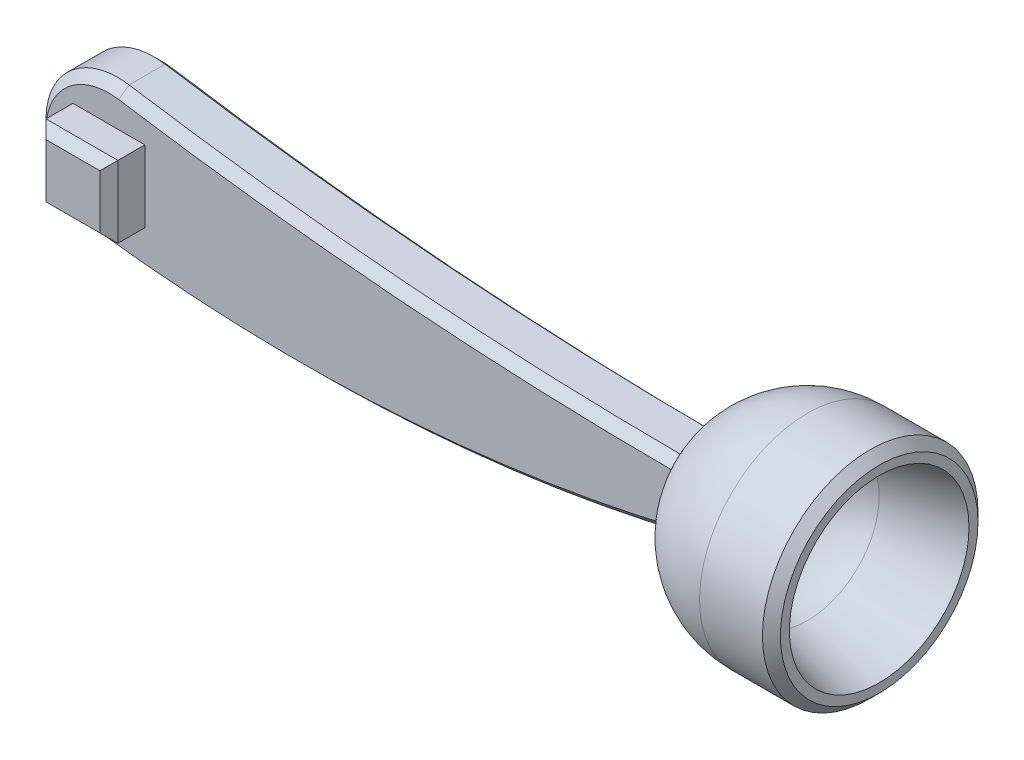
ISO-10303-21;
HEADER;
FILE_DESCRIPTION(('STEP AP214'),'2;1');
FILE_NAME('part.step','',(''),(''),'','','');
FILE_SCHEMA(('AUTOMOTIVE_DESIGN { 1 0 10303 214 1 1 1 1 }'));
ENDSEC;
DATA;
#1=APPLICATION_CONTEXT('core data for automotive mechanical design processes');
#2=APPLICATION_PROTOCOL_DEFINITION('international standard','automotive_design',2000,#1);
#3=PRODUCT_CONTEXT('',#1,'mechanical');
#4=PRODUCT('Part','Part','',(#3));
#5=PRODUCT_RELATED_PRODUCT_CATEGORY('part','',(#4));
#6=PRODUCT_DEFINITION_FORMATION('','',#4);
#7=PRODUCT_DEFINITION_CONTEXT('part definition',#1,'design');
#8=PRODUCT_DEFINITION('design','',#6,#7);
#9=PRODUCT_DEFINITION_SHAPE('','',#8);
#10=(LENGTH_UNIT() NAMED_UNIT(*) SI_UNIT(.MILLI.,.METRE.));
#11=(NAMED_UNIT(*) PLANE_ANGLE_UNIT() SI_UNIT($,.RADIAN.));
#12=(NAMED_UNIT(*) SI_UNIT($,.STERADIAN.) SOLID_ANGLE_UNIT());
#13=UNCERTAINTY_MEASURE_WITH_UNIT(LENGTH_MEASURE(1.E-05),#10,'distance_accuracy_value','');
#14=(GEOMETRIC_REPRESENTATION_CONTEXT(3) GLOBAL_UNCERTAINTY_ASSIGNED_CONTEXT((#13)) GLOBAL_UNIT_ASSIGNED_CONTEXT((#10,
#11,#12)) REPRESENTATION_CONTEXT('',''));
#15=CARTESIAN_POINT('',(0.,0.,0.));
#16=DIRECTION('',(0.,0.,1.));
#17=DIRECTION('',(1.,0.,0.));
#18=AXIS2_PLACEMENT_3D('',#15,#16,#17);
#19=CARTESIAN_POINT('',(0.,0.,7.5));
#20=DIRECTION('',(0.,0.,1.));
#21=DIRECTION('',(1.,0.,0.));
#22=AXIS2_PLACEMENT_3D('',#19,#20,#21);
#23=PLANE('',#22);
#24=CARTESIAN_POINT('',(101.914257424823,0.,7.5));
#25=DIRECTION('',(0.,0.,1.));
#26=DIRECTION('',(1.,0.,0.));
#27=AXIS2_PLACEMENT_3D('',#24,#25,#26);
#28=CIRCLE('',#27,29.0473750965556);
#29=CARTESIAN_POINT('',(73.2911495192701,4.94648297551503,7.5));
#30=VERTEX_POINT('',#29);
#31=CARTESIAN_POINT('',(73.9949003405566,-8.01620234283062,7.5));
#32=VERTEX_POINT('',#31);
#33=EDGE_CURVE('E166',#30,#32,#28,.T.);
#34=ORIENTED_EDGE('',*,*,#33,.F.);
#35=CARTESIAN_POINT('',(74.5404411764697,1007.44570455644,7.5));
#36=DIRECTION('',(0.,0.,1.));
#37=DIRECTION('',(1.,0.,0.));
#38=AXIS2_PLACEMENT_3D('',#35,#36,#37);
#39=CIRCLE('',#38,1002.5);
#40=CARTESIAN_POINT('',(-82.262786548443,17.284607676213,7.5));
#41=VERTEX_POINT('',#40);
#42=EDGE_CURVE('E318',#30,#41,#39,.F.);
#43=ORIENTED_EDGE('',*,*,#42,.T.);
#44=CARTESIAN_POINT('',(-85.,0.,7.5));
#45=DIRECTION('',(0.,0.,1.));
#46=DIRECTION('',(1.,0.,0.));
#47=AXIS2_PLACEMENT_3D('',#44,#45,#46);
#48=CIRCLE('',#47,17.4999999999998);
#49=CARTESIAN_POINT('',(-87.1538346443228,-17.366951267419,7.5));
#50=VERTEX_POINT('',#49);
#51=EDGE_CURVE('E335',#41,#50,#48,.T.);
#52=ORIENTED_EDGE('',*,*,#51,.T.);
#53=CARTESIAN_POINT('',(-32.0772058823531,426.730802570873,7.5));
#54=DIRECTION('',(0.,0.,1.));
#55=DIRECTION('',(1.,0.,0.));
#56=AXIS2_PLACEMENT_3D('',#53,#54,#55);
#57=CIRCLE('',#56,447.5);
#58=EDGE_CURVE('E332',#50,#32,#57,.T.);
#59=ORIENTED_EDGE('',*,*,#58,.T.);
#60=EDGE_LOOP('',(#34,#43,#52,#59));
#61=FACE_BOUND('',#60,.T.);
#62=DIRECTION('',(-1.,0.,0.));
#63=VECTOR('',#62,1.);
#64=CARTESIAN_POINT('',(-95.,10.,7.5));
#65=LINE('',#64,#63);
#66=CARTESIAN_POINT('',(-75.,10.,7.5));
#67=VERTEX_POINT('',#66);
#68=CARTESIAN_POINT('',(-95.,10.,7.5));
#69=VERTEX_POINT('',#68);
#70=EDGE_CURVE('E380',#67,#69,#65,.T.);
#71=ORIENTED_EDGE('',*,*,#70,.F.);
#72=DIRECTION('',(0.,1.,0.));
#73=VECTOR('',#72,1.);
#74=CARTESIAN_POINT('',(-75.,10.,7.5));
#75=LINE('',#74,#73);
#76=CARTESIAN_POINT('',(-75.,-10.,7.5));
#77=VERTEX_POINT('',#76);
#78=EDGE_CURVE('E374',#77,#67,#75,.T.);
#79=ORIENTED_EDGE('',*,*,#78,.F.);
#80=DIRECTION('',(1.,0.,0.));
#81=VECTOR('',#80,1.);
#82=CARTESIAN_POINT('',(-95.,-10.,7.5));
#83=LINE('',#82,#81);
#84=CARTESIAN_POINT('',(-95.,-10.,7.5));
#85=VERTEX_POINT('',#84);
#86=EDGE_CURVE('E391',#85,#77,#83,.T.);
#87=ORIENTED_EDGE('',*,*,#86,.F.);
#88=DIRECTION('',(0.,-1.,0.));
#89=VECTOR('',#88,1.);
#90=CARTESIAN_POINT('',(-95.,10.,7.5));
#91=LINE('',#90,#89);
#92=EDGE_CURVE('E386',#69,#85,#91,.T.);
#93=ORIENTED_EDGE('',*,*,#92,.F.);
#94=EDGE_LOOP('',(#71,#79,#87,#93));
#95=FACE_BOUND('',#94,.T.);
#96=ADVANCED_FACE('F45',(#61,#95),#23,.T.);
#97=CARTESIAN_POINT('',(-32.0772058823531,426.730802570873,7.5));
#98=DIRECTION('',(0.,0.,-1.));
#99=DIRECTION('',(-1.,0.,0.));
#100=AXIS2_PLACEMENT_3D('',#97,#98,#99);
#101=CYLINDRICAL_SURFACE('',#100,450.);
#102=CARTESIAN_POINT('',(-32.0772058823531,426.730802570873,-4.99999999999994));
#103=DIRECTION('',(0.,0.,1.));
#104=DIRECTION('',(1.,0.,0.));
#105=AXIS2_PLACEMENT_3D('',#102,#103,#104);
#106=CIRCLE('',#105,450.);
#107=CARTESIAN_POINT('',(-87.4615253077975,-19.847944305622,-4.99999999999994));
#108=VERTEX_POINT('',#107);
#109=CARTESIAN_POINT('',(74.2687364606456,-10.5226028443162,-4.99999999999994));
#110=VERTEX_POINT('',#109);
#111=EDGE_CURVE('E159',#108,#110,#106,.T.);
#112=ORIENTED_EDGE('',*,*,#111,.T.);
#113=CARTESIAN_POINT('',(74.2687695686907,-10.5225947919906,-5.00019999999994));
#114=CARTESIAN_POINT('',(74.2001978446423,-10.5392715353171,-4.58598398739804));
#115=CARTESIAN_POINT('',(74.1401511807636,-10.5538595525276,-4.17031957643629));
#116=CARTESIAN_POINT('',(74.0371975512156,-10.5788546815061,-3.33675034776046));
#117=CARTESIAN_POINT('',(73.9942905109663,-10.5892618114665,-2.9188455398031));
#118=CARTESIAN_POINT('',(73.8919121019454,-10.6140857190417,-1.66885072105893));
#119=CARTESIAN_POINT('',(73.8577834845445,-10.6223476725385,-0.834425360529481));
#120=CARTESIAN_POINT('',(73.8577834845445,-10.6223476725385,0.834425360529423));
#121=CARTESIAN_POINT('',(73.8919121019453,-10.6140857190417,1.66885072105888));
#122=CARTESIAN_POINT('',(73.9942905109663,-10.5892618114665,2.91884553980304));
#123=CARTESIAN_POINT('',(74.0371975512156,-10.5788546815061,3.3367503477604));
#124=CARTESIAN_POINT('',(74.1401511807636,-10.5538595525276,4.17031957643623));
#125=CARTESIAN_POINT('',(74.2001978446423,-10.5392715353171,4.58598398739798));
#126=CARTESIAN_POINT('',(74.2687695686907,-10.5225947919905,5.00019999999988));
#127=B_SPLINE_CURVE_WITH_KNOTS('',3,(#113,#114,#115,#116,#117,#118,#119,#120,#121,#122,#123,
#124,#125,#126),.UNSPECIFIED.,.F.,.F.,(4,2,2,2,2,2,4),(0.,1.26036718598642,2.52072888764981,
5.02308696773882,7.52544504782782,8.78580674949122,10.0461739354776),.UNSPECIFIED.);
#128=CARTESIAN_POINT('',(74.2687364606456,-10.5226028443163,4.99999999999983));
#129=VERTEX_POINT('',#128);
#130=EDGE_CURVE('E163',#110,#129,#127,.T.);
#131=ORIENTED_EDGE('',*,*,#130,.T.);
#132=CARTESIAN_POINT('',(-32.0772058823531,426.730802570873,4.99999999999989));
#133=DIRECTION('',(0.,0.,1.));
#134=DIRECTION('',(1.,0.,0.));
#135=AXIS2_PLACEMENT_3D('',#132,#133,#134);
#136=CIRCLE('',#135,450.);
#137=CARTESIAN_POINT('',(-87.4615253077975,-19.847944305622,4.99999999999989));
#138=VERTEX_POINT('',#137);
#139=EDGE_CURVE('E148',#129,#138,#136,.F.);
#140=ORIENTED_EDGE('',*,*,#139,.T.);
#141=DIRECTION('',(0.,0.,-1.));
#142=VECTOR('',#141,1.);
#143=CARTESIAN_POINT('',(-87.4615253077975,-19.847944305622,7.5));
#144=LINE('',#143,#142);
#145=EDGE_CURVE('E345',#138,#108,#144,.T.);
#146=ORIENTED_EDGE('',*,*,#145,.T.);
#147=EDGE_LOOP('',(#112,#131,#140,#146));
#148=FACE_BOUND('',#147,.T.);
#149=ADVANCED_FACE('F164',(#148),#101,.T.);
#150=CARTESIAN_POINT('',(74.5404411764697,1007.44570455644,7.5));
#151=DIRECTION('',(0.,0.,-1.));
#152=DIRECTION('',(-1.,0.,0.));
#153=AXIS2_PLACEMENT_3D('',#150,#151,#152);
#154=CYLINDRICAL_SURFACE('',#153,1000.);
#155=CARTESIAN_POINT('',(73.286512563604,7.44649072522967,-5.00019999999994));
#156=CARTESIAN_POINT('',(73.2142090344155,7.44658177137517,-4.58610748719957));
#157=CARTESIAN_POINT('',(73.150899769748,7.44666856853838,-4.17049403536112));
#158=CARTESIAN_POINT('',(73.0423598376574,7.44682513670235,-3.33691553209663));
#159=CARTESIAN_POINT('',(72.9971290674816,7.44689490779988,-2.91895049404999));
#160=CARTESIAN_POINT('',(72.8892408705057,7.44706502047559,-1.66895586641359));
#161=CARTESIAN_POINT('',(72.8532820902201,7.44712781031577,-0.834477933206809));
#162=CARTESIAN_POINT('',(72.8532820902201,7.4471278103158,0.834477933206751));
#163=CARTESIAN_POINT('',(72.8892408705057,7.44706502047566,1.66895586641353));
#164=CARTESIAN_POINT('',(72.9971290674815,7.44689490779986,2.91895049404994));
#165=CARTESIAN_POINT('',(73.0423598376574,7.44682513670227,3.33691553209658));
#166=CARTESIAN_POINT('',(73.150899769748,7.44666856853826,4.17049403536106));
#167=CARTESIAN_POINT('',(73.2142090344155,7.44658177137507,4.58610748719951));
#168=CARTESIAN_POINT('',(73.286512563604,7.44649072522968,5.00019999999989));
#169=B_SPLINE_CURVE_WITH_KNOTS('',3,(#155,#156,#157,#158,#159,#160,#161,#162,#163,#164,#165,
#166,#167,#168),.UNSPECIFIED.,.F.,.F.,(4,2,2,2,2,2,4),(0.,1.26087622855957,2.52174529057719,
5.02421637768941,7.52668746480162,8.78755652681925,10.0484327553788),.UNSPECIFIED.);
#170=CARTESIAN_POINT('',(73.2864776431684,7.44649076901804,-4.99999999999994));
#171=VERTEX_POINT('',#170);
#172=CARTESIAN_POINT('',(73.2864776431684,7.44649076901793,4.99999999999989));
#173=VERTEX_POINT('',#172);
#174=EDGE_CURVE('E228',#171,#173,#169,.T.);
#175=ORIENTED_EDGE('',*,*,#174,.F.);
#176=CARTESIAN_POINT('',(74.5404411764697,1007.44570455644,-4.99999999999994));
#177=DIRECTION('',(0.,0.,1.));
#178=DIRECTION('',(1.,0.,0.));
#179=AXIS2_PLACEMENT_3D('',#176,#177,#178);
#180=CIRCLE('',#179,1000.);
#181=CARTESIAN_POINT('',(-81.8717560553633,19.7538373442439,-4.99999999999994));
#182=VERTEX_POINT('',#181);
#183=EDGE_CURVE('E323',#171,#182,#180,.F.);
#184=ORIENTED_EDGE('',*,*,#183,.T.);
#185=DIRECTION('',(0.,0.,-1.));
#186=VECTOR('',#185,1.);
#187=CARTESIAN_POINT('',(-81.8717560553633,19.7538373442439,7.5));
#188=LINE('',#187,#186);
#189=CARTESIAN_POINT('',(-81.8717560553633,19.7538373442439,4.99999999999989));
#190=VERTEX_POINT('',#189);
#191=EDGE_CURVE('E322',#190,#182,#188,.T.);
#192=ORIENTED_EDGE('',*,*,#191,.F.);
#193=CARTESIAN_POINT('',(74.5404411764697,1007.44570455644,4.99999999999989));
#194=DIRECTION('',(0.,0.,1.));
#195=DIRECTION('',(1.,0.,0.));
#196=AXIS2_PLACEMENT_3D('',#193,#194,#195);
#197=CIRCLE('',#196,1000.);
#198=EDGE_CURVE('E309',#190,#173,#197,.T.);
#199=ORIENTED_EDGE('',*,*,#198,.T.);
#200=EDGE_LOOP('',(#175,#184,#192,#199));
#201=FACE_BOUND('',#200,.T.);
#202=ADVANCED_FACE('F242',(#201),#154,.F.);
#203=CARTESIAN_POINT('',(-85.,0.,7.5));
#204=DIRECTION('',(0.,0.,-1.));
#205=DIRECTION('',(-1.,0.,0.));
#206=AXIS2_PLACEMENT_3D('',#203,#204,#205);
#207=CYLINDRICAL_SURFACE('',#206,20.);
#208=ORIENTED_EDGE('',*,*,#191,.T.);
#209=CARTESIAN_POINT('',(-85.,0.,-4.99999999999994));
#210=DIRECTION('',(0.,0.,1.));
#211=DIRECTION('',(1.,0.,0.));
#212=AXIS2_PLACEMENT_3D('',#209,#210,#211);
#213=CIRCLE('',#212,20.);
#214=EDGE_CURVE('E160',#182,#108,#213,.T.);
#215=ORIENTED_EDGE('',*,*,#214,.T.);
#216=ORIENTED_EDGE('',*,*,#145,.F.);
#217=CARTESIAN_POINT('',(-85.,0.,4.99999999999989));
#218=DIRECTION('',(0.,0.,1.));
#219=DIRECTION('',(1.,0.,0.));
#220=AXIS2_PLACEMENT_3D('',#217,#218,#219);
#221=CIRCLE('',#220,20.);
#222=EDGE_CURVE('E325',#138,#190,#221,.F.);
#223=ORIENTED_EDGE('',*,*,#222,.T.);
#224=EDGE_LOOP('',(#208,#215,#216,#223));
#225=FACE_BOUND('',#224,.T.);
#226=ADVANCED_FACE('F246',(#225),#207,.T.);
#227=CARTESIAN_POINT('',(0.,0.,-7.5));
#228=DIRECTION('',(0.,0.,1.));
#229=DIRECTION('',(1.,0.,0.));
#230=AXIS2_PLACEMENT_3D('',#227,#228,#229);
#231=PLANE('',#230);
#232=CARTESIAN_POINT('',(-85.,0.,-7.5));
#233=DIRECTION('',(0.,0.,1.));
#234=DIRECTION('',(1.,0.,0.));
#235=AXIS2_PLACEMENT_3D('',#232,#233,#234);
#236=CIRCLE('',#235,5.);
#237=CARTESIAN_POINT('',(-80.,0.,-7.5));
#238=VERTEX_POINT('',#237);
#239=EDGE_CURVE('E174',#238,#238,#236,.F.);
#240=ORIENTED_EDGE('',*,*,#239,.F.);
#241=EDGE_LOOP('',(#240));
#242=FACE_BOUND('',#241,.T.);
#243=CARTESIAN_POINT('',(74.5404411764697,1007.44570455644,-7.5));
#244=DIRECTION('',(0.,0.,1.));
#245=DIRECTION('',(1.,0.,0.));
#246=AXIS2_PLACEMENT_3D('',#243,#244,#245);
#247=CIRCLE('',#246,1002.5);
#248=CARTESIAN_POINT('',(-82.2627865484429,17.2846076762134,-7.5));
#249=VERTEX_POINT('',#248);
#250=CARTESIAN_POINT('',(73.2911495192702,4.94648297551525,-7.5));
#251=VERTEX_POINT('',#250);
#252=EDGE_CURVE('E304',#249,#251,#247,.T.);
#253=ORIENTED_EDGE('',*,*,#252,.T.);
#254=CARTESIAN_POINT('',(101.914257424823,0.,-7.5));
#255=DIRECTION('',(0.,0.,1.));
#256=DIRECTION('',(1.,0.,0.));
#257=AXIS2_PLACEMENT_3D('',#254,#255,#256);
#258=CIRCLE('',#257,29.0473750965556);
#259=CARTESIAN_POINT('',(73.9949003405566,-8.01620234283079,-7.5));
#260=VERTEX_POINT('',#259);
#261=EDGE_CURVE('E61',#251,#260,#258,.T.);
#262=ORIENTED_EDGE('',*,*,#261,.T.);
#263=CARTESIAN_POINT('',(-32.0772058823531,426.730802570873,-7.5));
#264=DIRECTION('',(0.,0.,1.));
#265=DIRECTION('',(1.,0.,0.));
#266=AXIS2_PLACEMENT_3D('',#263,#264,#265);
#267=CIRCLE('',#266,447.5);
#268=CARTESIAN_POINT('',(-87.1538346443228,-17.3669512674192,-7.5));
#269=VERTEX_POINT('',#268);
#270=EDGE_CURVE('E403',#260,#269,#267,.F.);
#271=ORIENTED_EDGE('',*,*,#270,.T.);
#272=CARTESIAN_POINT('',(-85.,0.,-7.5));
#273=DIRECTION('',(0.,0.,1.));
#274=DIRECTION('',(1.,0.,0.));
#275=AXIS2_PLACEMENT_3D('',#272,#273,#274);
#276=CIRCLE('',#275,17.5);
#277=EDGE_CURVE('E306',#269,#249,#276,.F.);
#278=ORIENTED_EDGE('',*,*,#277,.T.);
#279=EDGE_LOOP('',(#253,#262,#271,#278));
#280=FACE_BOUND('',#279,.T.);
#281=ADVANCED_FACE('F272',(#242,#280),#231,.F.);
#282=CARTESIAN_POINT('',(-85.,0.,-4.99999999999994));
#283=DIRECTION('',(0.,0.,1.));
#284=DIRECTION('',(1.,0.,0.));
#285=AXIS2_PLACEMENT_3D('',#282,#283,#284);
#286=CONICAL_SURFACE('',#285,20.,0.785398163397444);
#287=DIRECTION('',(0.110600125322921,0.698403617028542,0.70710678118655));
#288=VECTOR('',#287,1.);
#289=CARTESIAN_POINT('',(-82.2627865484429,17.2846076762134,-7.5));
#290=LINE('',#289,#288);
#291=EDGE_CURVE('E339',#249,#182,#290,.T.);
#292=ORIENTED_EDGE('',*,*,#291,.F.);
#293=ORIENTED_EDGE('',*,*,#277,.F.);
#294=DIRECTION('',(0.0870280618602952,0.701730800555909,-0.707106781186551));
#295=VECTOR('',#294,1.);
#296=CARTESIAN_POINT('',(-87.4615253077975,-19.847944305622,-4.99999999999994));
#297=LINE('',#296,#295);
#298=EDGE_CURVE('E341',#108,#269,#297,.T.);
#299=ORIENTED_EDGE('',*,*,#298,.F.);
#300=ORIENTED_EDGE('',*,*,#214,.F.);
#301=EDGE_LOOP('',(#292,#293,#299,#300));
#302=FACE_BOUND('',#301,.T.);
#303=ADVANCED_FACE('F268',(#302),#286,.T.);
#304=CARTESIAN_POINT('',(-32.0772058823531,426.730802570873,-4.99999999999994));
#305=DIRECTION('',(0.,0.,1.));
#306=DIRECTION('',(1.,0.,0.));
#307=AXIS2_PLACEMENT_3D('',#304,#305,#306);
#308=CONICAL_SURFACE('',#307,450.,0.785398163397448);
#309=CARTESIAN_POINT('',(74.2687750608708,-10.5227992865202,-4.99979999999994));
#310=CARTESIAN_POINT('',(74.1879259381294,-10.1111815768424,-5.41887583292754));
#311=CARTESIAN_POINT('',(74.1246780643506,-9.69647258998657,-5.83678041610308));
#312=CARTESIAN_POINT('',(74.0333848147386,-8.86087206210038,-6.67024708276874));
#313=CARTESIAN_POINT('',(74.0053394388899,-8.43998052107275,-7.08580916625989));
#314=CARTESIAN_POINT('',(73.9948953119886,-8.01599770286971,-7.50019999999999));
#315=B_SPLINE_CURVE_WITH_KNOTS('',3,(#309,#310,#311,#312,#313,#314),.UNSPECIFIED.,.F.,.F.,(4,2,
4),(0.,1.77641568941536,3.55283137805793),.UNSPECIFIED.);
#316=EDGE_CURVE('E68',#110,#260,#315,.T.);
#317=ORIENTED_EDGE('',*,*,#316,.F.);
#318=ORIENTED_EDGE('',*,*,#111,.F.);
#319=ORIENTED_EDGE('',*,*,#298,.T.);
#320=ORIENTED_EDGE('',*,*,#270,.F.);
#321=EDGE_LOOP('',(#317,#318,#319,#320));
#322=FACE_BOUND('',#321,.T.);
#323=ADVANCED_FACE('F260',(#322),#308,.T.);
#324=CARTESIAN_POINT('',(74.5404411764697,1007.44570455644,-7.5));
#325=DIRECTION('',(0.,0.,-1.));
#326=DIRECTION('',(-1.,0.,0.));
#327=AXIS2_PLACEMENT_3D('',#324,#325,#326);
#328=CONICAL_SURFACE('',#327,1002.5,0.785398163397426);
#329=CARTESIAN_POINT('',(73.291167359151,4.94628295312843,-7.5002));
#330=CARTESIAN_POINT('',(73.2540319952611,5.36300683110372,-7.08352385363975));
#331=CARTESIAN_POINT('',(73.2350749276173,5.77973608630963,-6.66681911379298));
#332=CARTESIAN_POINT('',(73.2335173848215,6.61320535118287,-5.83335244712628));
#333=CARTESIAN_POINT('',(73.2509169096695,7.02994536085019,-5.41659052030635));
#334=CARTESIAN_POINT('',(73.2864947307635,7.44669074774815,-4.99979999999991));
#335=B_SPLINE_CURVE_WITH_KNOTS('',3,(#329,#330,#331,#332,#333,#334),.UNSPECIFIED.,.F.,.F.,(4,2,
4),(0.,1.76889495022177,3.53778990044409),.UNSPECIFIED.);
#336=EDGE_CURVE('E235',#251,#171,#335,.T.);
#337=ORIENTED_EDGE('',*,*,#336,.F.);
#338=ORIENTED_EDGE('',*,*,#252,.F.);
#339=ORIENTED_EDGE('',*,*,#291,.T.);
#340=ORIENTED_EDGE('',*,*,#183,.F.);
#341=EDGE_LOOP('',(#337,#338,#339,#340));
#342=FACE_BOUND('',#341,.T.);
#343=ADVANCED_FACE('F252',(#342),#328,.F.);
#344=CARTESIAN_POINT('',(74.5404411764697,1007.44570455644,4.99999999999989));
#345=DIRECTION('',(0.,0.,1.));
#346=DIRECTION('',(1.,0.,0.));
#347=AXIS2_PLACEMENT_3D('',#344,#345,#346);
#348=CONICAL_SURFACE('',#347,1000.,0.785398163397459);
#349=CARTESIAN_POINT('',(73.2864947307635,7.44669074774815,4.99979999999994));
#350=CARTESIAN_POINT('',(73.2509169096695,7.02994536085015,5.41659052030637));
#351=CARTESIAN_POINT('',(73.2335173848214,6.6132053511828,5.83335244712629));
#352=CARTESIAN_POINT('',(73.2350749276173,5.77973608630951,6.66681911379299));
#353=CARTESIAN_POINT('',(73.2540319952611,5.36300683110357,7.08352385363977));
#354=CARTESIAN_POINT('',(73.2911673591509,4.94628295312827,7.50020000000003));
#355=B_SPLINE_CURVE_WITH_KNOTS('',3,(#349,#350,#351,#352,#353,#354),.UNSPECIFIED.,.F.,.F.,(4,2,
4),(0.,1.76889495022238,3.53778990044421),.UNSPECIFIED.);
#356=EDGE_CURVE('E215',#173,#30,#355,.T.);
#357=ORIENTED_EDGE('',*,*,#356,.F.);
#358=ORIENTED_EDGE('',*,*,#198,.F.);
#359=DIRECTION('',(0.11060012532292,0.698403617028558,-0.707106781186535));
#360=VECTOR('',#359,1.);
#361=CARTESIAN_POINT('',(-82.262786548443,17.284607676213,7.5));
#362=LINE('',#361,#360);
#363=EDGE_CURVE('E342',#41,#190,#362,.T.);
#364=ORIENTED_EDGE('',*,*,#363,.F.);
#365=ORIENTED_EDGE('',*,*,#42,.F.);
#366=EDGE_LOOP('',(#357,#358,#364,#365));
#367=FACE_BOUND('',#366,.T.);
#368=ADVANCED_FACE('F259',(#367),#348,.F.);
#369=CARTESIAN_POINT('',(-32.0772058823531,426.730802570873,7.5));
#370=DIRECTION('',(0.,0.,-1.));
#371=DIRECTION('',(-1.,0.,0.));
#372=AXIS2_PLACEMENT_3D('',#369,#370,#371);
#373=CONICAL_SURFACE('',#372,447.5,0.78539816339747);
#374=CARTESIAN_POINT('',(73.9948953119886,-8.01599770286956,7.50019999999997));
#375=CARTESIAN_POINT('',(74.0053394388899,-8.43998052107262,7.08580916625987));
#376=CARTESIAN_POINT('',(74.0333848147385,-8.86087206210028,6.67024708276873));
#377=CARTESIAN_POINT('',(74.1246780643506,-9.69647258998652,5.83678041610306));
#378=CARTESIAN_POINT('',(74.1879259381293,-10.1111815768424,5.41887583292752));
#379=CARTESIAN_POINT('',(74.2687750608708,-10.5227992865202,4.99979999999991));
#380=B_SPLINE_CURVE_WITH_KNOTS('',3,(#374,#375,#376,#377,#378,#379),.UNSPECIFIED.,.F.,.F.,(4,2,
4),(0.,1.77641568864262,3.55283137805804),.UNSPECIFIED.);
#381=EDGE_CURVE('E153',#32,#129,#380,.T.);
#382=ORIENTED_EDGE('',*,*,#381,.F.);
#383=ORIENTED_EDGE('',*,*,#58,.F.);
#384=DIRECTION('',(0.0870280618602982,0.701730800555932,0.707106781186527));
#385=VECTOR('',#384,1.);
#386=CARTESIAN_POINT('',(-87.4615253077975,-19.847944305622,4.99999999999989));
#387=LINE('',#386,#385);
#388=EDGE_CURVE('E155',#138,#50,#387,.T.);
#389=ORIENTED_EDGE('',*,*,#388,.F.);
#390=ORIENTED_EDGE('',*,*,#139,.F.);
#391=EDGE_LOOP('',(#382,#383,#389,#390));
#392=FACE_BOUND('',#391,.T.);
#393=ADVANCED_FACE('F150',(#392),#373,.T.);
#394=CARTESIAN_POINT('',(-85.,0.,7.5));
#395=DIRECTION('',(0.,0.,-1.));
#396=DIRECTION('',(-1.,0.,0.));
#397=AXIS2_PLACEMENT_3D('',#394,#395,#396);
#398=CONICAL_SURFACE('',#397,17.4999999999998,0.785398163397466);
#399=ORIENTED_EDGE('',*,*,#363,.T.);
#400=ORIENTED_EDGE('',*,*,#222,.F.);
#401=ORIENTED_EDGE('',*,*,#388,.T.);
#402=ORIENTED_EDGE('',*,*,#51,.F.);
#403=EDGE_LOOP('',(#399,#400,#401,#402));
#404=FACE_BOUND('',#403,.T.);
#405=ADVANCED_FACE('F275',(#404),#398,.T.);
#406=CARTESIAN_POINT('',(-75.,10.,17.5));
#407=DIRECTION('',(-1.,0.,0.));
#408=DIRECTION('',(0.,0.,1.));
#409=AXIS2_PLACEMENT_3D('',#406,#407,#408);
#410=PLANE('',#409);
#411=DIRECTION('',(0.,0.,-1.));
#412=VECTOR('',#411,1.);
#413=CARTESIAN_POINT('',(-75.,10.,17.5));
#414=LINE('',#413,#412);
#415=CARTESIAN_POINT('',(-75.,10.,15.));
#416=VERTEX_POINT('',#415);
#417=EDGE_CURVE('E347',#416,#67,#414,.T.);
#418=ORIENTED_EDGE('',*,*,#417,.F.);
#419=DIRECTION('',(0.,-1.,0.));
#420=VECTOR('',#419,1.);
#421=CARTESIAN_POINT('',(-75.,-10.,15.));
#422=LINE('',#421,#420);
#423=CARTESIAN_POINT('',(-75.,-10.,15.));
#424=VERTEX_POINT('',#423);
#425=EDGE_CURVE('E179',#416,#424,#422,.T.);
#426=ORIENTED_EDGE('',*,*,#425,.T.);
#427=DIRECTION('',(0.,0.,-1.));
#428=VECTOR('',#427,1.);
#429=CARTESIAN_POINT('',(-75.,-10.,17.5));
#430=LINE('',#429,#428);
#431=EDGE_CURVE('E394',#424,#77,#430,.T.);
#432=ORIENTED_EDGE('',*,*,#431,.T.);
#433=ORIENTED_EDGE('',*,*,#78,.T.);
#434=EDGE_LOOP('',(#418,#426,#432,#433));
#435=FACE_BOUND('',#434,.T.);
#436=ADVANCED_FACE('F280',(#435),#410,.F.);
#437=CARTESIAN_POINT('',(-95.,10.,17.5));
#438=DIRECTION('',(0.,-1.,0.));
#439=DIRECTION('',(0.,0.,-1.));
#440=AXIS2_PLACEMENT_3D('',#437,#438,#439);
#441=PLANE('',#440);
#442=DIRECTION('',(0.,0.,-1.));
#443=VECTOR('',#442,1.);
#444=CARTESIAN_POINT('',(-95.,10.,17.5));
#445=LINE('',#444,#443);
#446=CARTESIAN_POINT('',(-95.,10.,15.));
#447=VERTEX_POINT('',#446);
#448=EDGE_CURVE('E398',#447,#69,#445,.T.);
#449=ORIENTED_EDGE('',*,*,#448,.F.);
#450=DIRECTION('',(1.,0.,0.));
#451=VECTOR('',#450,1.);
#452=CARTESIAN_POINT('',(-75.,10.,15.));
#453=LINE('',#452,#451);
#454=EDGE_CURVE('E357',#447,#416,#453,.T.);
#455=ORIENTED_EDGE('',*,*,#454,.T.);
#456=ORIENTED_EDGE('',*,*,#417,.T.);
#457=ORIENTED_EDGE('',*,*,#70,.T.);
#458=EDGE_LOOP('',(#449,#455,#456,#457));
#459=FACE_BOUND('',#458,.T.);
#460=ADVANCED_FACE('F286',(#459),#441,.F.);
#461=CARTESIAN_POINT('',(-95.,10.,17.5));
#462=DIRECTION('',(1.,0.,0.));
#463=DIRECTION('',(0.,0.,-1.));
#464=AXIS2_PLACEMENT_3D('',#461,#462,#463);
#465=PLANE('',#464);
#466=DIRECTION('',(0.,0.,-1.));
#467=VECTOR('',#466,1.);
#468=CARTESIAN_POINT('',(-95.,-10.,17.5));
#469=LINE('',#468,#467);
#470=CARTESIAN_POINT('',(-95.,-10.,15.));
#471=VERTEX_POINT('',#470);
#472=EDGE_CURVE('E396',#471,#85,#469,.T.);
#473=ORIENTED_EDGE('',*,*,#472,.F.);
#474=DIRECTION('',(0.,1.,0.));
#475=VECTOR('',#474,1.);
#476=CARTESIAN_POINT('',(-95.,10.,15.));
#477=LINE('',#476,#475);
#478=EDGE_CURVE('E360',#471,#447,#477,.T.);
#479=ORIENTED_EDGE('',*,*,#478,.T.);
#480=ORIENTED_EDGE('',*,*,#448,.T.);
#481=ORIENTED_EDGE('',*,*,#92,.T.);
#482=EDGE_LOOP('',(#473,#479,#480,#481));
#483=FACE_BOUND('',#482,.T.);
#484=ADVANCED_FACE('F432',(#483),#465,.F.);
#485=CARTESIAN_POINT('',(-95.,-10.,17.5));
#486=DIRECTION('',(0.,1.,0.));
#487=DIRECTION('',(0.,0.,1.));
#488=AXIS2_PLACEMENT_3D('',#485,#486,#487);
#489=PLANE('',#488);
#490=ORIENTED_EDGE('',*,*,#431,.F.);
#491=DIRECTION('',(-1.,0.,0.));
#492=VECTOR('',#491,1.);
#493=CARTESIAN_POINT('',(-95.,-10.,15.));
#494=LINE('',#493,#492);
#495=EDGE_CURVE('E362',#424,#471,#494,.T.);
#496=ORIENTED_EDGE('',*,*,#495,.T.);
#497=ORIENTED_EDGE('',*,*,#472,.T.);
#498=ORIENTED_EDGE('',*,*,#86,.T.);
#499=EDGE_LOOP('',(#490,#496,#497,#498));
#500=FACE_BOUND('',#499,.T.);
#501=ADVANCED_FACE('F428',(#500),#489,.F.);
#502=CARTESIAN_POINT('',(0.,0.,17.5));
#503=DIRECTION('',(0.,0.,1.));
#504=DIRECTION('',(1.,0.,0.));
#505=AXIS2_PLACEMENT_3D('',#502,#503,#504);
#506=PLANE('',#505);
#507=DIRECTION('',(0.,1.,0.));
#508=VECTOR('',#507,1.);
#509=CARTESIAN_POINT('',(-77.5,10.,17.5));
#510=LINE('',#509,#508);
#511=CARTESIAN_POINT('',(-77.5,-7.5,17.5));
#512=VERTEX_POINT('',#511);
#513=CARTESIAN_POINT('',(-77.5,7.5,17.5));
#514=VERTEX_POINT('',#513);
#515=EDGE_CURVE('E338',#512,#514,#510,.T.);
#516=ORIENTED_EDGE('',*,*,#515,.T.);
#517=DIRECTION('',(-1.,0.,0.));
#518=VECTOR('',#517,1.);
#519=CARTESIAN_POINT('',(-95.,7.5,17.5));
#520=LINE('',#519,#518);
#521=CARTESIAN_POINT('',(-92.5,7.5,17.5));
#522=VERTEX_POINT('',#521);
#523=EDGE_CURVE('E354',#514,#522,#520,.T.);
#524=ORIENTED_EDGE('',*,*,#523,.T.);
#525=DIRECTION('',(0.,-1.,0.));
#526=VECTOR('',#525,1.);
#527=CARTESIAN_POINT('',(-92.5,-10.,17.5));
#528=LINE('',#527,#526);
#529=CARTESIAN_POINT('',(-92.5,-7.5,17.5));
#530=VERTEX_POINT('',#529);
#531=EDGE_CURVE('E352',#522,#530,#528,.T.);
#532=ORIENTED_EDGE('',*,*,#531,.T.);
#533=DIRECTION('',(1.,0.,0.));
#534=VECTOR('',#533,1.);
#535=CARTESIAN_POINT('',(-75.,-7.5,17.5));
#536=LINE('',#535,#534);
#537=EDGE_CURVE('E350',#530,#512,#536,.T.);
#538=ORIENTED_EDGE('',*,*,#537,.T.);
#539=EDGE_LOOP('',(#516,#524,#532,#538));
#540=FACE_BOUND('',#539,.T.);
#541=ADVANCED_FACE('F424',(#540),#506,.T.);
#542=CARTESIAN_POINT('',(0.,-7.5,17.5));
#543=DIRECTION('',(0.,-0.707106781186551,0.707106781186543));
#544=DIRECTION('',(-1.,0.,0.));
#545=AXIS2_PLACEMENT_3D('',#542,#543,#544);
#546=PLANE('',#545);
#547=DIRECTION('',(-0.577350269189624,-0.577350269189624,-0.57735026918963));
#548=VECTOR('',#547,1.);
#549=CARTESIAN_POINT('',(-61.6666666666669,23.3333333333331,48.3333333333334));
#550=LINE('',#549,#548);
#551=EDGE_CURVE('E370',#471,#530,#550,.F.);
#552=ORIENTED_EDGE('',*,*,#551,.F.);
#553=ORIENTED_EDGE('',*,*,#495,.F.);
#554=DIRECTION('',(0.577350269189624,-0.577350269189624,-0.57735026918963));
#555=VECTOR('',#554,1.);
#556=CARTESIAN_POINT('',(-80.,-5.00000000000002,20.));
#557=LINE('',#556,#555);
#558=EDGE_CURVE('E372',#512,#424,#557,.T.);
#559=ORIENTED_EDGE('',*,*,#558,.F.);
#560=ORIENTED_EDGE('',*,*,#537,.F.);
#561=EDGE_LOOP('',(#552,#553,#559,#560));
#562=FACE_BOUND('',#561,.T.);
#563=ADVANCED_FACE('F427',(#562),#546,.T.);
#564=CARTESIAN_POINT('',(-77.5,0.,17.5));
#565=DIRECTION('',(0.707106781186551,0.,0.707106781186543));
#566=DIRECTION('',(0.,-1.,0.));
#567=AXIS2_PLACEMENT_3D('',#564,#565,#566);
#568=PLANE('',#567);
#569=ORIENTED_EDGE('',*,*,#558,.T.);
#570=ORIENTED_EDGE('',*,*,#425,.F.);
#571=DIRECTION('',(-0.577350269189624,-0.577350269189624,0.57735026918963));
#572=VECTOR('',#571,1.);
#573=CARTESIAN_POINT('',(-80.,5.00000000000002,20.));
#574=LINE('',#573,#572);
#575=EDGE_CURVE('E367',#514,#416,#574,.F.);
#576=ORIENTED_EDGE('',*,*,#575,.F.);
#577=ORIENTED_EDGE('',*,*,#515,.F.);
#578=EDGE_LOOP('',(#569,#570,#576,#577));
#579=FACE_BOUND('',#578,.T.);
#580=ADVANCED_FACE('F451',(#579),#568,.T.);
#581=CARTESIAN_POINT('',(-92.5,0.,17.5));
#582=DIRECTION('',(-0.707106781186551,0.,0.707106781186543));
#583=DIRECTION('',(0.,1.,0.));
#584=AXIS2_PLACEMENT_3D('',#581,#582,#583);
#585=PLANE('',#584);
#586=ORIENTED_EDGE('',*,*,#551,.T.);
#587=ORIENTED_EDGE('',*,*,#531,.F.);
#588=DIRECTION('',(-0.577350269189624,0.577350269189624,-0.57735026918963));
#589=VECTOR('',#588,1.);
#590=CARTESIAN_POINT('',(-90.,5.00000000000002,20.));
#591=LINE('',#590,#589);
#592=EDGE_CURVE('E365',#447,#522,#591,.F.);
#593=ORIENTED_EDGE('',*,*,#592,.F.);
#594=ORIENTED_EDGE('',*,*,#478,.F.);
#595=EDGE_LOOP('',(#586,#587,#593,#594));
#596=FACE_BOUND('',#595,.T.);
#597=ADVANCED_FACE('F420',(#596),#585,.T.);
#598=CARTESIAN_POINT('',(0.,7.5,17.5));
#599=DIRECTION('',(0.,0.707106781186551,0.707106781186543));
#600=DIRECTION('',(1.,0.,0.));
#601=AXIS2_PLACEMENT_3D('',#598,#599,#600);
#602=PLANE('',#601);
#603=ORIENTED_EDGE('',*,*,#575,.T.);
#604=ORIENTED_EDGE('',*,*,#454,.F.);
#605=ORIENTED_EDGE('',*,*,#592,.T.);
#606=ORIENTED_EDGE('',*,*,#523,.F.);
#607=EDGE_LOOP('',(#603,#604,#605,#606));
#608=FACE_BOUND('',#607,.T.);
#609=ADVANCED_FACE('F415',(#608),#602,.T.);
#610=CARTESIAN_POINT('',(-85.,0.,-17.5));
#611=DIRECTION('',(0.,0.,1.));
#612=DIRECTION('',(1.,0.,0.));
#613=AXIS2_PLACEMENT_3D('',#610,#611,#612);
#614=CYLINDRICAL_SURFACE('',#613,5.);
#615=CARTESIAN_POINT('',(-85.,0.,-17.5));
#616=DIRECTION('',(0.,0.,-1.));
#617=DIRECTION('',(-1.,0.,0.));
#618=AXIS2_PLACEMENT_3D('',#615,#616,#617);
#619=CIRCLE('',#618,5.);
#620=CARTESIAN_POINT('',(-90.,0.,-17.5));
#621=VERTEX_POINT('',#620);
#622=EDGE_CURVE('E368',#621,#621,#619,.T.);
#623=ORIENTED_EDGE('',*,*,#622,.F.);
#624=EDGE_LOOP('',(#623));
#625=FACE_BOUND('',#624,.T.);
#626=ORIENTED_EDGE('',*,*,#239,.T.);
#627=EDGE_LOOP('',(#626));
#628=FACE_BOUND('',#627,.T.);
#629=ADVANCED_FACE('F412',(#625,#628),#614,.T.);
#630=CARTESIAN_POINT('',(-85.,0.,-17.5));
#631=DIRECTION('',(0.,0.,-1.));
#632=DIRECTION('',(-1.,0.,0.));
#633=AXIS2_PLACEMENT_3D('',#630,#631,#632);
#634=PLANE('',#633);
#635=ORIENTED_EDGE('',*,*,#622,.T.);
#636=EDGE_LOOP('',(#635));
#637=FACE_BOUND('',#636,.T.);
#638=ADVANCED_FACE('F197',(#637),#634,.T.);
#639=CARTESIAN_POINT('',(101.914257424823,0.,0.));
#640=DIRECTION('',(-1.,0.,0.));
#641=DIRECTION('',(0.,0.,1.));
#642=AXIS2_PLACEMENT_3D('',#639,#640,#641);
#643=SPHERICAL_SURFACE('',#642,30.);
#644=ORIENTED_EDGE('',*,*,#261,.F.);
#645=ORIENTED_EDGE('',*,*,#336,.T.);
#646=ORIENTED_EDGE('',*,*,#174,.T.);
#647=ORIENTED_EDGE('',*,*,#356,.T.);
#648=ORIENTED_EDGE('',*,*,#33,.T.);
#649=ORIENTED_EDGE('',*,*,#381,.T.);
#650=ORIENTED_EDGE('',*,*,#130,.F.);
#651=ORIENTED_EDGE('',*,*,#316,.T.);
#652=EDGE_LOOP('',(#644,#645,#646,#647,#648,#649,#650,#651));
#653=FACE_BOUND('',#652,.T.);
#654=CARTESIAN_POINT('',(101.914257424823,0.,0.));
#655=DIRECTION('',(1.,0.,0.));
#656=DIRECTION('',(0.,0.,-1.));
#657=AXIS2_PLACEMENT_3D('',#654,#655,#656);
#658=CIRCLE('',#657,30.);
#659=CARTESIAN_POINT('',(101.914257424823,0.,-30.));
#660=VERTEX_POINT('',#659);
#661=EDGE_CURVE('E485',#660,#660,#658,.T.);
#662=ORIENTED_EDGE('',*,*,#661,.F.);
#663=EDGE_LOOP('',(#662));
#664=FACE_BOUND('',#663,.T.);
#665=ADVANCED_FACE('F170',(#653,#664),#643,.T.);
#666=CARTESIAN_POINT('',(121.914257424823,0.,0.));
#667=DIRECTION('',(1.,0.,0.));
#668=DIRECTION('',(0.,0.,-1.));
#669=AXIS2_PLACEMENT_3D('',#666,#667,#668);
#670=PLANE('',#669);
#671=CARTESIAN_POINT('',(121.914257424823,0.,0.));
#672=DIRECTION('',(1.,0.,0.));
#673=DIRECTION('',(0.,0.,-1.));
#674=AXIS2_PLACEMENT_3D('',#671,#672,#673);
#675=CIRCLE('',#674,27.5);
#676=CARTESIAN_POINT('',(121.914257424823,0.,-27.5));
#677=VERTEX_POINT('',#676);
#678=EDGE_CURVE('E54',#677,#677,#675,.T.);
#679=ORIENTED_EDGE('',*,*,#678,.T.);
#680=EDGE_LOOP('',(#679));
#681=FACE_BOUND('',#680,.T.);
#682=CARTESIAN_POINT('',(121.914257424823,0.,0.));
#683=DIRECTION('',(1.,0.,0.));
#684=DIRECTION('',(0.,0.,-1.));
#685=AXIS2_PLACEMENT_3D('',#682,#683,#684);
#686=CIRCLE('',#685,25.0000000000002);
#687=CARTESIAN_POINT('',(121.914257424823,0.,-25.0000000000002));
#688=VERTEX_POINT('',#687);
#689=EDGE_CURVE('E173',#688,#688,#686,.F.);
#690=ORIENTED_EDGE('',*,*,#689,.T.);
#691=EDGE_LOOP('',(#690));
#692=FACE_BOUND('',#691,.T.);
#693=ADVANCED_FACE('F196',(#681,#692),#670,.T.);
#694=CARTESIAN_POINT('',(121.914257424823,0.,0.));
#695=DIRECTION('',(-1.,0.,0.));
#696=DIRECTION('',(0.,0.,1.));
#697=AXIS2_PLACEMENT_3D('',#694,#695,#696);
#698=CYLINDRICAL_SURFACE('',#697,30.);
#699=CARTESIAN_POINT('',(119.414257424823,0.,0.));
#700=DIRECTION('',(1.,0.,0.));
#701=DIRECTION('',(0.,0.,-1.));
#702=AXIS2_PLACEMENT_3D('',#699,#700,#701);
#703=CIRCLE('',#702,30.);
#704=CARTESIAN_POINT('',(119.414257424823,0.,-30.));
#705=VERTEX_POINT('',#704);
#706=EDGE_CURVE('E11',#705,#705,#703,.F.);
#707=ORIENTED_EDGE('',*,*,#706,.T.);
#708=EDGE_LOOP('',(#707));
#709=FACE_BOUND('',#708,.T.);
#710=ORIENTED_EDGE('',*,*,#661,.T.);
#711=EDGE_LOOP('',(#710));
#712=FACE_BOUND('',#711,.T.);
#713=ADVANCED_FACE('F479',(#709,#712),#698,.T.);
#714=CARTESIAN_POINT('',(101.914257424823,0.,0.));
#715=DIRECTION('',(-1.,0.,0.));
#716=DIRECTION('',(0.,0.,1.));
#717=AXIS2_PLACEMENT_3D('',#714,#715,#716);
#718=SPHERICAL_SURFACE('',#717,20.0000000000001);
#719=CARTESIAN_POINT('',(101.914257424823,0.,0.));
#720=DIRECTION('',(-1.,0.,0.));
#721=DIRECTION('',(0.,0.,1.));
#722=AXIS2_PLACEMENT_3D('',#719,#720,#721);
#723=CIRCLE('',#722,20.0000000000001);
#724=CARTESIAN_POINT('',(101.914257424823,0.,20.0000000000001));
#725=VERTEX_POINT('',#724);
#726=EDGE_CURVE('E167',#725,#725,#723,.T.);
#727=ORIENTED_EDGE('',*,*,#726,.F.);
#728=EDGE_LOOP('',(#727));
#729=FACE_BOUND('',#728,.T.);
#730=ADVANCED_FACE('F198',(#729),#718,.F.);
#731=CARTESIAN_POINT('',(101.914257424823,0.,0.));
#732=DIRECTION('',(1.,0.,0.));
#733=DIRECTION('',(0.,0.,-1.));
#734=AXIS2_PLACEMENT_3D('',#731,#732,#733);
#735=CONICAL_SURFACE('',#734,20.0000000000001,0.244978663126861);
#736=ORIENTED_EDGE('',*,*,#689,.F.);
#737=EDGE_LOOP('',(#736));
#738=FACE_BOUND('',#737,.T.);
#739=ORIENTED_EDGE('',*,*,#726,.T.);
#740=EDGE_LOOP('',(#739));
#741=FACE_BOUND('',#740,.T.);
#742=ADVANCED_FACE('F468',(#738,#741),#735,.F.);
#743=CARTESIAN_POINT('',(121.914257424823,0.,0.));
#744=DIRECTION('',(-1.,0.,0.));
#745=DIRECTION('',(0.,0.,1.));
#746=AXIS2_PLACEMENT_3D('',#743,#744,#745);
#747=CONICAL_SURFACE('',#746,27.5,0.785398163397443);
#748=ORIENTED_EDGE('',*,*,#706,.F.);
#749=EDGE_LOOP('',(#748));
#750=FACE_BOUND('',#749,.T.);
#751=ORIENTED_EDGE('',*,*,#678,.F.);
#752=EDGE_LOOP('',(#751));
#753=FACE_BOUND('',#752,.T.);
#754=ADVANCED_FACE('F48',(#750,#753),#747,.T.);
#755=CLOSED_SHELL('',(#96,#149,#202,#226,#281,#303,#323,#343,#368,#393,#405,#436,#460,#484,#501,
#541,#563,#580,#597,#609,#629,#638,#665,#693,#713,#730,#742,#754));
#756=MANIFOLD_SOLID_BREP('B2',#755);
#757=ADVANCED_BREP_SHAPE_REPRESENTATION('',(#18,#756),#14);
#758=SHAPE_DEFINITION_REPRESENTATION(#9,#757);
ENDSEC;
END-ISO-10303-21;
